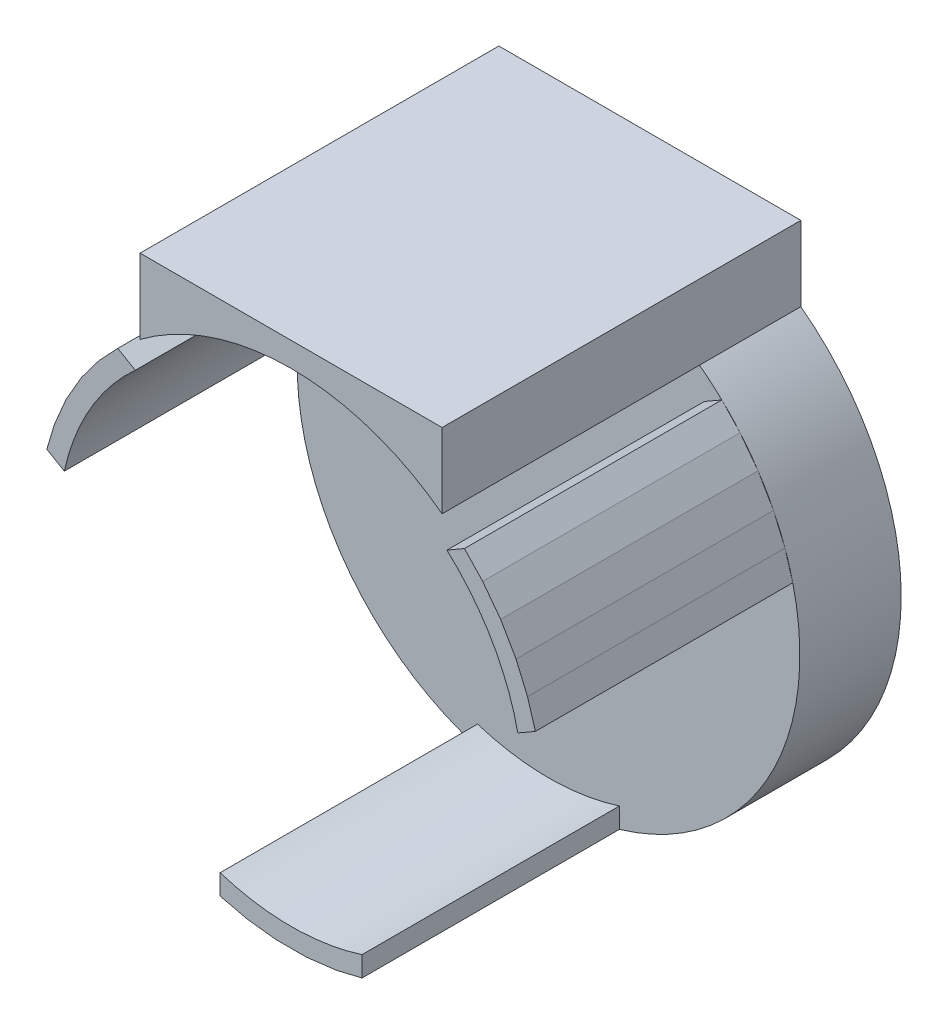
ISO-10303-21;
HEADER;
FILE_DESCRIPTION(('STEP AP214'),'2;1');
FILE_NAME('part.step','',(''),(''),'','','');
FILE_SCHEMA(('AUTOMOTIVE_DESIGN { 1 0 10303 214 1 1 1 1 }'));
ENDSEC;
DATA;
#1=APPLICATION_CONTEXT('core data for automotive mechanical design processes');
#2=APPLICATION_PROTOCOL_DEFINITION('international standard','automotive_design',2000,#1);
#3=PRODUCT_CONTEXT('',#1,'mechanical');
#4=PRODUCT('Part','Part','',(#3));
#5=PRODUCT_RELATED_PRODUCT_CATEGORY('part','',(#4));
#6=PRODUCT_DEFINITION_FORMATION('','',#4);
#7=PRODUCT_DEFINITION_CONTEXT('part definition',#1,'design');
#8=PRODUCT_DEFINITION('design','',#6,#7);
#9=PRODUCT_DEFINITION_SHAPE('','',#8);
#10=(LENGTH_UNIT() NAMED_UNIT(*) SI_UNIT(.MILLI.,.METRE.));
#11=(NAMED_UNIT(*) PLANE_ANGLE_UNIT() SI_UNIT($,.RADIAN.));
#12=(NAMED_UNIT(*) SI_UNIT($,.STERADIAN.) SOLID_ANGLE_UNIT());
#13=UNCERTAINTY_MEASURE_WITH_UNIT(LENGTH_MEASURE(1.E-05),#10,'distance_accuracy_value','');
#14=(GEOMETRIC_REPRESENTATION_CONTEXT(3) GLOBAL_UNCERTAINTY_ASSIGNED_CONTEXT((#13)) GLOBAL_UNIT_ASSIGNED_CONTEXT((#10,
#11,#12)) REPRESENTATION_CONTEXT('',''));
#15=CARTESIAN_POINT('',(0.,0.,0.));
#16=DIRECTION('',(0.,0.,1.));
#17=DIRECTION('',(1.,0.,0.));
#18=AXIS2_PLACEMENT_3D('',#15,#16,#17);
#19=CARTESIAN_POINT('',(0.,0.,5.));
#20=DIRECTION('',(0.,0.,-1.));
#21=DIRECTION('',(-1.,0.,0.));
#22=AXIS2_PLACEMENT_3D('',#19,#20,#21);
#23=PLANE('',#22);
#24=DIRECTION('',(-0.686711519341494,0.726930044229633,0.));
#25=VECTOR('',#24,1.);
#26=CARTESIAN_POINT('',(8.55206290021574,8.97898770189343,5.));
#27=LINE('',#26,#25);
#28=CARTESIAN_POINT('',(9.4506878529183,8.02773312378422,5.));
#29=VERTEX_POINT('',#28);
#30=CARTESIAN_POINT('',(8.55206290021575,8.97898770189343,5.));
#31=VERTEX_POINT('',#30);
#32=EDGE_CURVE('E267',#29,#31,#27,.T.);
#33=ORIENTED_EDGE('',*,*,#32,.F.);
#34=CARTESIAN_POINT('',(0.,0.,5.));
#35=DIRECTION('',(0.,0.,1.));
#36=DIRECTION('',(1.,0.,0.));
#37=AXIS2_PLACEMENT_3D('',#34,#35,#36);
#38=CIRCLE('',#37,12.4);
#39=EDGE_CURVE('E548',#29,#31,#38,.T.);
#40=ORIENTED_EDGE('',*,*,#39,.T.);
#41=EDGE_LOOP('',(#33,#40));
#42=FACE_BOUND('',#41,.T.);
#43=ADVANCED_FACE('F57',(#42),#23,.F.);
#44=DIRECTION('',(-0.866025403784444,-0.49999999999999,0.));
#45=VECTOR('',#44,1.);
#46=CARTESIAN_POINT('',(8.55206290021574,8.97898770189343,5.));
#47=LINE('',#46,#45);
#48=CARTESIAN_POINT('',(7.6860374964313,8.47898770189344,5.));
#49=VERTEX_POINT('',#48);
#50=EDGE_CURVE('E484',#31,#49,#47,.T.);
#51=ORIENTED_EDGE('',*,*,#50,.F.);
#52=CARTESIAN_POINT('',(7.45,9.91249211853407,5.));
#53=VERTEX_POINT('',#52);
#54=EDGE_CURVE('E265',#31,#53,#38,.T.);
#55=ORIENTED_EDGE('',*,*,#54,.T.);
#56=CARTESIAN_POINT('',(0.,0.,5.));
#57=DIRECTION('',(0.,0.,1.));
#58=DIRECTION('',(-1.,0.,0.));
#59=AXIS2_PLACEMENT_3D('',#56,#57,#58);
#60=CIRCLE('',#59,12.4);
#61=CARTESIAN_POINT('',(-7.45,9.91249211853407,5.));
#62=VERTEX_POINT('',#61);
#63=EDGE_CURVE('E248',#53,#62,#60,.T.);
#64=ORIENTED_EDGE('',*,*,#63,.T.);
#65=CARTESIAN_POINT('',(-8.55206290021562,8.97898770189355,5.));
#66=VERTEX_POINT('',#65);
#67=EDGE_CURVE('E262',#62,#66,#38,.T.);
#68=ORIENTED_EDGE('',*,*,#67,.T.);
#69=DIRECTION('',(-0.866025403784437,0.500000000000003,0.));
#70=VECTOR('',#69,1.);
#71=CARTESIAN_POINT('',(-8.55206290021563,8.97898770189355,5.));
#72=LINE('',#71,#70);
#73=CARTESIAN_POINT('',(-7.68603749643119,8.47898770189355,5.));
#74=VERTEX_POINT('',#73);
#75=EDGE_CURVE('E418',#74,#66,#72,.T.);
#76=ORIENTED_EDGE('',*,*,#75,.F.);
#77=CARTESIAN_POINT('',(0.,0.,5.));
#78=DIRECTION('',(0.,0.,-1.));
#79=DIRECTION('',(1.,0.,0.));
#80=AXIS2_PLACEMENT_3D('',#77,#78,#79);
#81=CIRCLE('',#80,11.4441428182896);
#82=CARTESIAN_POINT('',(-11.1860374964312,2.41680987540249,5.));
#83=VERTEX_POINT('',#82);
#84=EDGE_CURVE('E420',#83,#74,#81,.T.);
#85=ORIENTED_EDGE('',*,*,#84,.F.);
#86=DIRECTION('',(0.866025403784436,-0.500000000000004,0.));
#87=VECTOR('',#86,1.);
#88=CARTESIAN_POINT('',(-12.0520629002157,2.91680987540249,5.));
#89=LINE('',#88,#87);
#90=CARTESIAN_POINT('',(-12.0520629002157,2.91680987540249,5.));
#91=VERTEX_POINT('',#90);
#92=EDGE_CURVE('E423',#91,#83,#89,.T.);
#93=ORIENTED_EDGE('',*,*,#92,.F.);
#94=CARTESIAN_POINT('',(-3.50000000000001,-11.8957975772959,5.));
#95=VERTEX_POINT('',#94);
#96=EDGE_CURVE('E556',#91,#95,#38,.T.);
#97=ORIENTED_EDGE('',*,*,#96,.T.);
#98=DIRECTION('',(0.,-1.,0.));
#99=VECTOR('',#98,1.);
#100=CARTESIAN_POINT('',(-3.50000000000001,-11.8957975772959,5.));
#101=LINE('',#100,#99);
#102=CARTESIAN_POINT('',(-3.50000000000001,-10.8957975772959,5.));
#103=VERTEX_POINT('',#102);
#104=EDGE_CURVE('E353',#103,#95,#101,.T.);
#105=ORIENTED_EDGE('',*,*,#104,.F.);
#106=CARTESIAN_POINT('',(0.,0.,5.));
#107=DIRECTION('',(0.,0.,-1.));
#108=DIRECTION('',(1.,0.,0.));
#109=AXIS2_PLACEMENT_3D('',#106,#107,#108);
#110=CIRCLE('',#109,11.4441428182895);
#111=CARTESIAN_POINT('',(3.5,-10.8957975772959,5.));
#112=VERTEX_POINT('',#111);
#113=EDGE_CURVE('E356',#112,#103,#110,.T.);
#114=ORIENTED_EDGE('',*,*,#113,.F.);
#115=DIRECTION('',(0.,1.,0.));
#116=VECTOR('',#115,1.);
#117=CARTESIAN_POINT('',(3.5,-11.8957975772959,5.));
#118=LINE('',#117,#116);
#119=CARTESIAN_POINT('',(3.5,-11.8957975772959,5.));
#120=VERTEX_POINT('',#119);
#121=EDGE_CURVE('E359',#120,#112,#118,.T.);
#122=ORIENTED_EDGE('',*,*,#121,.F.);
#123=CARTESIAN_POINT('',(12.0520629002157,2.91680987540232,5.));
#124=VERTEX_POINT('',#123);
#125=EDGE_CURVE('E555',#120,#124,#38,.T.);
#126=ORIENTED_EDGE('',*,*,#125,.T.);
#127=DIRECTION('',(0.866025403784443,0.499999999999992,0.));
#128=VECTOR('',#127,1.);
#129=CARTESIAN_POINT('',(12.0520629002157,2.91680987540232,5.));
#130=LINE('',#129,#128);
#131=CARTESIAN_POINT('',(11.1860374964313,2.41680987540233,5.));
#132=VERTEX_POINT('',#131);
#133=EDGE_CURVE('E77',#132,#124,#130,.T.);
#134=ORIENTED_EDGE('',*,*,#133,.F.);
#135=CARTESIAN_POINT('',(0.,0.,5.));
#136=DIRECTION('',(0.,0.,-1.));
#137=DIRECTION('',(1.,0.,0.));
#138=AXIS2_PLACEMENT_3D('',#135,#136,#137);
#139=CIRCLE('',#138,11.4441428182895);
#140=EDGE_CURVE('E72',#49,#132,#139,.T.);
#141=ORIENTED_EDGE('',*,*,#140,.F.);
#142=EDGE_LOOP('',(#51,#55,#64,#68,#76,#85,#93,#97,#105,#114,#122,#126,#134,#141));
#143=FACE_BOUND('',#142,.T.);
#144=ADVANCED_FACE('F261',(#143),#23,.F.);
#145=DIRECTION('',(-0.287733652538625,0.957710470443328,0.));
#146=VECTOR('',#145,1.);
#147=CARTESIAN_POINT('',(11.66401107031,4.20842556684639,5.));
#148=LINE('',#147,#146);
#149=CARTESIAN_POINT('',(11.66401107031,4.20842556684627,5.));
#150=VERTEX_POINT('',#149);
#151=EDGE_CURVE('E479',#124,#150,#148,.T.);
#152=ORIENTED_EDGE('',*,*,#151,.F.);
#153=EDGE_CURVE('E552',#124,#150,#38,.T.);
#154=ORIENTED_EDGE('',*,*,#153,.T.);
#155=EDGE_LOOP('',(#152,#154));
#156=FACE_BOUND('',#155,.T.);
#157=ADVANCED_FACE('F628',(#156),#23,.F.);
#158=DIRECTION('',(-0.393355900948917,0.919386281814486,0.));
#159=VECTOR('',#158,1.);
#160=CARTESIAN_POINT('',(11.0984133929242,5.53039059739548,5.));
#161=LINE('',#160,#159);
#162=CARTESIAN_POINT('',(11.0984133929243,5.5303905973954,5.));
#163=VERTEX_POINT('',#162);
#164=EDGE_CURVE('E476',#150,#163,#161,.T.);
#165=ORIENTED_EDGE('',*,*,#164,.F.);
#166=EDGE_CURVE('E551',#150,#163,#38,.T.);
#167=ORIENTED_EDGE('',*,*,#166,.T.);
#168=EDGE_LOOP('',(#165,#167));
#169=FACE_BOUND('',#168,.T.);
#170=ADVANCED_FACE('F942',(#169),#23,.F.);
#171=DIRECTION('',(-0.499999999999992,0.866025403784443,0.));
#172=VECTOR('',#171,1.);
#173=CARTESIAN_POINT('',(10.3386654466573,6.84631264127592,5.));
#174=LINE('',#173,#172);
#175=CARTESIAN_POINT('',(10.3386654466573,6.84631264127592,5.));
#176=VERTEX_POINT('',#175);
#177=EDGE_CURVE('E473',#163,#176,#174,.T.);
#178=ORIENTED_EDGE('',*,*,#177,.F.);
#179=EDGE_CURVE('E545',#163,#176,#38,.T.);
#180=ORIENTED_EDGE('',*,*,#179,.T.);
#181=EDGE_LOOP('',(#178,#180));
#182=FACE_BOUND('',#181,.T.);
#183=ADVANCED_FACE('F550',(#182),#23,.F.);
#184=DIRECTION('',(-0.600827751338299,0.799378516862796,0.));
#185=VECTOR('',#184,1.);
#186=CARTESIAN_POINT('',(9.4506878529183,8.02773312378422,5.));
#187=LINE('',#186,#185);
#188=EDGE_CURVE('E469',#176,#29,#187,.T.);
#189=ORIENTED_EDGE('',*,*,#188,.F.);
#190=EDGE_CURVE('E540',#176,#29,#38,.T.);
#191=ORIENTED_EDGE('',*,*,#190,.T.);
#192=EDGE_LOOP('',(#189,#191));
#193=FACE_BOUND('',#192,.T.);
#194=ADVANCED_FACE('F539',(#193),#23,.F.);
#195=DIRECTION('',(-0.286184125406257,-0.958174642935961,0.));
#196=VECTOR('',#195,1.);
#197=CARTESIAN_POINT('',(-12.0520629002157,2.91680987540249,5.));
#198=LINE('',#197,#196);
#199=CARTESIAN_POINT('',(-11.6775647464581,4.1706692019721,5.));
#200=VERTEX_POINT('',#199);
#201=EDGE_CURVE('E426',#200,#91,#198,.T.);
#202=ORIENTED_EDGE('',*,*,#201,.F.);
#203=EDGE_CURVE('E560',#200,#91,#38,.T.);
#204=ORIENTED_EDGE('',*,*,#203,.T.);
#205=EDGE_LOOP('',(#202,#204));
#206=FACE_BOUND('',#205,.T.);
#207=ADVANCED_FACE('F918',(#206),#23,.F.);
#208=DIRECTION('',(-0.685534770604952,-0.728039887843802,0.));
#209=VECTOR('',#208,1.);
#210=CARTESIAN_POINT('',(-9.47660898597993,7.99711711348812,5.));
#211=LINE('',#210,#209);
#212=CARTESIAN_POINT('',(-9.47660898597989,7.99711711348816,5.));
#213=VERTEX_POINT('',#212);
#214=EDGE_CURVE('E415',#66,#213,#211,.T.);
#215=ORIENTED_EDGE('',*,*,#214,.F.);
#216=EDGE_CURVE('E277',#66,#213,#38,.T.);
#217=ORIENTED_EDGE('',*,*,#216,.T.);
#218=EDGE_LOOP('',(#215,#217));
#219=FACE_BOUND('',#218,.T.);
#220=ADVANCED_FACE('F909',(#219),#23,.F.);
#221=DIRECTION('',(-0.599533925467801,-0.800349343857524,0.));
#222=VECTOR('',#221,1.);
#223=CARTESIAN_POINT('',(-10.3386654466572,6.84631264127603,5.));
#224=LINE('',#223,#222);
#225=CARTESIAN_POINT('',(-10.3386654466572,6.84631264127604,5.));
#226=VERTEX_POINT('',#225);
#227=EDGE_CURVE('E412',#213,#226,#224,.T.);
#228=ORIENTED_EDGE('',*,*,#227,.F.);
#229=EDGE_CURVE('E1066',#213,#226,#38,.T.);
#230=ORIENTED_EDGE('',*,*,#229,.T.);
#231=EDGE_LOOP('',(#228,#230));
#232=FACE_BOUND('',#231,.T.);
#233=ADVANCED_FACE('F900',(#232),#23,.F.);
#234=DIRECTION('',(-0.500000000000003,-0.866025403784437,0.));
#235=VECTOR('',#234,1.);
#236=CARTESIAN_POINT('',(-11.0984133929242,5.5303905973956,5.));
#237=LINE('',#236,#235);
#238=CARTESIAN_POINT('',(-11.0984133929242,5.5303905973956,5.));
#239=VERTEX_POINT('',#238);
#240=EDGE_CURVE('E409',#226,#239,#237,.T.);
#241=ORIENTED_EDGE('',*,*,#240,.F.);
#242=EDGE_CURVE('E1064',#226,#239,#38,.T.);
#243=ORIENTED_EDGE('',*,*,#242,.T.);
#244=EDGE_LOOP('',(#241,#243));
#245=FACE_BOUND('',#244,.T.);
#246=ADVANCED_FACE('F638',(#245),#23,.F.);
#247=DIRECTION('',(-0.391868227173555,-0.920021354389046,0.));
#248=VECTOR('',#247,1.);
#249=CARTESIAN_POINT('',(-11.6775647464581,4.1706692019721,5.));
#250=LINE('',#249,#248);
#251=EDGE_CURVE('E405',#239,#200,#250,.T.);
#252=ORIENTED_EDGE('',*,*,#251,.F.);
#253=EDGE_CURVE('E564',#239,#200,#38,.T.);
#254=ORIENTED_EDGE('',*,*,#253,.T.);
#255=EDGE_LOOP('',(#252,#254));
#256=FACE_BOUND('',#255,.T.);
#257=ADVANCED_FACE('F632',(#256),#23,.F.);
#258=DIRECTION('',(0.972895644747753,0.231244598706334,0.));
#259=VECTOR('',#258,1.);
#260=CARTESIAN_POINT('',(3.5,-11.8957975772959,5.));
#261=LINE('',#260,#259);
#262=CARTESIAN_POINT('',(2.2268768935399,-12.1984023257564,5.));
#263=VERTEX_POINT('',#262);
#264=EDGE_CURVE('E362',#263,#120,#261,.T.);
#265=ORIENTED_EDGE('',*,*,#264,.F.);
#266=EDGE_CURVE('E559',#263,#120,#38,.T.);
#267=ORIENTED_EDGE('',*,*,#266,.T.);
#268=EDGE_LOOP('',(#265,#267));
#269=FACE_BOUND('',#268,.T.);
#270=ADVANCED_FACE('F583',(#269),#23,.F.);
#271=DIRECTION('',(0.973268423143583,-0.229670582599521,0.));
#272=VECTOR('',#271,1.);
#273=CARTESIAN_POINT('',(-2.18740208432998,-12.2055426803346,5.));
#274=LINE('',#273,#272);
#275=CARTESIAN_POINT('',(-2.18740208432992,-12.2055426803346,5.));
#276=VERTEX_POINT('',#275);
#277=EDGE_CURVE('E350',#95,#276,#274,.T.);
#278=ORIENTED_EDGE('',*,*,#277,.F.);
#279=EDGE_CURVE('E279',#95,#276,#38,.T.);
#280=ORIENTED_EDGE('',*,*,#279,.T.);
#281=EDGE_LOOP('',(#278,#280));
#282=FACE_BOUND('',#281,.T.);
#283=ADVANCED_FACE('F631',(#282),#23,.F.);
#284=DIRECTION('',(0.992889826416724,-0.119036937956956,0.));
#285=VECTOR('',#284,1.);
#286=CARTESIAN_POINT('',(-0.759747946266912,-12.3767032386716,5.));
#287=LINE('',#286,#285);
#288=CARTESIAN_POINT('',(-0.759747946266983,-12.3767032386716,5.));
#289=VERTEX_POINT('',#288);
#290=EDGE_CURVE('E347',#276,#289,#287,.T.);
#291=ORIENTED_EDGE('',*,*,#290,.F.);
#292=EDGE_CURVE('E566',#276,#289,#38,.T.);
#293=ORIENTED_EDGE('',*,*,#292,.T.);
#294=EDGE_LOOP('',(#291,#293));
#295=FACE_BOUND('',#294,.T.);
#296=ADVANCED_FACE('F637',(#295),#23,.F.);
#297=DIRECTION('',(1.,0.,0.));
#298=VECTOR('',#297,1.);
#299=CARTESIAN_POINT('',(0.759747946266947,-12.3767032386716,5.));
#300=LINE('',#299,#298);
#301=CARTESIAN_POINT('',(0.759747946266947,-12.3767032386716,5.));
#302=VERTEX_POINT('',#301);
#303=EDGE_CURVE('E344',#289,#302,#300,.T.);
#304=ORIENTED_EDGE('',*,*,#303,.F.);
#305=EDGE_CURVE('E570',#289,#302,#38,.T.);
#306=ORIENTED_EDGE('',*,*,#305,.T.);
#307=EDGE_LOOP('',(#304,#306));
#308=FACE_BOUND('',#307,.T.);
#309=ADVANCED_FACE('F641',(#308),#23,.F.);
#310=DIRECTION('',(0.992695978511857,0.120642837526258,0.));
#311=VECTOR('',#310,1.);
#312=CARTESIAN_POINT('',(2.2268768935399,-12.1984023257564,5.));
#313=LINE('',#312,#311);
#314=EDGE_CURVE('E340',#302,#263,#313,.T.);
#315=ORIENTED_EDGE('',*,*,#314,.F.);
#316=EDGE_CURVE('E574',#302,#263,#38,.T.);
#317=ORIENTED_EDGE('',*,*,#316,.T.);
#318=EDGE_LOOP('',(#315,#317));
#319=FACE_BOUND('',#318,.T.);
#320=ADVANCED_FACE('F597',(#319),#23,.F.);
#321=CARTESIAN_POINT('',(0.,0.,0.));
#322=DIRECTION('',(0.,0.,-1.));
#323=DIRECTION('',(-1.,0.,0.));
#324=AXIS2_PLACEMENT_3D('',#321,#322,#323);
#325=PLANE('',#324);
#326=CARTESIAN_POINT('',(0.,0.,0.));
#327=DIRECTION('',(0.,0.,1.));
#328=DIRECTION('',(1.,0.,0.));
#329=AXIS2_PLACEMENT_3D('',#326,#327,#328);
#330=CIRCLE('',#329,12.4);
#331=CARTESIAN_POINT('',(-7.45,9.91249211853407,0.));
#332=VERTEX_POINT('',#331);
#333=CARTESIAN_POINT('',(7.45,9.91249211853407,0.));
#334=VERTEX_POINT('',#333);
#335=EDGE_CURVE('E256',#332,#334,#330,.T.);
#336=ORIENTED_EDGE('',*,*,#335,.F.);
#337=DIRECTION('',(0.,-1.,0.));
#338=VECTOR('',#337,1.);
#339=CARTESIAN_POINT('',(-7.45,9.91249211853407,0.));
#340=LINE('',#339,#338);
#341=CARTESIAN_POINT('',(-7.45,13.6,0.));
#342=VERTEX_POINT('',#341);
#343=EDGE_CURVE('E283',#342,#332,#340,.T.);
#344=ORIENTED_EDGE('',*,*,#343,.F.);
#345=DIRECTION('',(-1.,0.,0.));
#346=VECTOR('',#345,1.);
#347=CARTESIAN_POINT('',(-7.45,13.6,0.));
#348=LINE('',#347,#346);
#349=CARTESIAN_POINT('',(7.45,13.6,0.));
#350=VERTEX_POINT('',#349);
#351=EDGE_CURVE('E295',#350,#342,#348,.T.);
#352=ORIENTED_EDGE('',*,*,#351,.F.);
#353=DIRECTION('',(0.,1.,0.));
#354=VECTOR('',#353,1.);
#355=CARTESIAN_POINT('',(7.45,9.91249211853407,0.));
#356=LINE('',#355,#354);
#357=EDGE_CURVE('E302',#334,#350,#356,.T.);
#358=ORIENTED_EDGE('',*,*,#357,.F.);
#359=EDGE_LOOP('',(#336,#344,#352,#358));
#360=FACE_BOUND('',#359,.T.);
#361=ADVANCED_FACE('F59',(#360),#325,.T.);
#362=CARTESIAN_POINT('',(0.,0.,5.));
#363=DIRECTION('',(0.,0.,-1.));
#364=DIRECTION('',(-1.,0.,0.));
#365=AXIS2_PLACEMENT_3D('',#362,#363,#364);
#366=CYLINDRICAL_SURFACE('',#365,12.4);
#367=ORIENTED_EDGE('',*,*,#335,.T.);
#368=DIRECTION('',(0.,0.,-1.));
#369=VECTOR('',#368,1.);
#370=CARTESIAN_POINT('',(7.45,9.91249211853407,5.));
#371=LINE('',#370,#369);
#372=EDGE_CURVE('E12',#53,#334,#371,.T.);
#373=ORIENTED_EDGE('',*,*,#372,.F.);
#374=ORIENTED_EDGE('',*,*,#54,.F.);
#375=ORIENTED_EDGE('',*,*,#39,.F.);
#376=ORIENTED_EDGE('',*,*,#190,.F.);
#377=ORIENTED_EDGE('',*,*,#179,.F.);
#378=ORIENTED_EDGE('',*,*,#166,.F.);
#379=ORIENTED_EDGE('',*,*,#153,.F.);
#380=ORIENTED_EDGE('',*,*,#125,.F.);
#381=ORIENTED_EDGE('',*,*,#266,.F.);
#382=ORIENTED_EDGE('',*,*,#316,.F.);
#383=ORIENTED_EDGE('',*,*,#305,.F.);
#384=ORIENTED_EDGE('',*,*,#292,.F.);
#385=ORIENTED_EDGE('',*,*,#279,.F.);
#386=ORIENTED_EDGE('',*,*,#96,.F.);
#387=ORIENTED_EDGE('',*,*,#203,.F.);
#388=ORIENTED_EDGE('',*,*,#253,.F.);
#389=ORIENTED_EDGE('',*,*,#242,.F.);
#390=ORIENTED_EDGE('',*,*,#229,.F.);
#391=ORIENTED_EDGE('',*,*,#216,.F.);
#392=ORIENTED_EDGE('',*,*,#67,.F.);
#393=DIRECTION('',(0.,0.,-1.));
#394=VECTOR('',#393,1.);
#395=CARTESIAN_POINT('',(-7.45,9.91249211853407,5.));
#396=LINE('',#395,#394);
#397=EDGE_CURVE('E273',#62,#332,#396,.T.);
#398=ORIENTED_EDGE('',*,*,#397,.T.);
#399=EDGE_LOOP('',(#367,#373,#374,#375,#376,#377,#378,#379,#380,#381,#382,#383,#384,#385,#386,
#387,#388,#389,#390,#391,#392,#398));
#400=FACE_BOUND('',#399,.T.);
#401=ADVANCED_FACE('F272',(#400),#366,.T.);
#402=CARTESIAN_POINT('',(7.45,9.91249211853407,5.));
#403=DIRECTION('',(-1.,0.,0.));
#404=DIRECTION('',(0.,0.,1.));
#405=AXIS2_PLACEMENT_3D('',#402,#403,#404);
#406=PLANE('',#405);
#407=ORIENTED_EDGE('',*,*,#357,.T.);
#408=DIRECTION('',(0.,0.,-1.));
#409=VECTOR('',#408,1.);
#410=CARTESIAN_POINT('',(7.45,13.6,5.));
#411=LINE('',#410,#409);
#412=CARTESIAN_POINT('',(7.45,13.6,17.7));
#413=VERTEX_POINT('',#412);
#414=EDGE_CURVE('E65',#413,#350,#411,.T.);
#415=ORIENTED_EDGE('',*,*,#414,.F.);
#416=DIRECTION('',(0.,1.,0.));
#417=VECTOR('',#416,1.);
#418=CARTESIAN_POINT('',(7.45,9.91249211853407,17.7));
#419=LINE('',#418,#417);
#420=CARTESIAN_POINT('',(7.45,9.91249211853407,17.7));
#421=VERTEX_POINT('',#420);
#422=EDGE_CURVE('E313',#421,#413,#419,.T.);
#423=ORIENTED_EDGE('',*,*,#422,.F.);
#424=DIRECTION('',(0.,0.,-1.));
#425=VECTOR('',#424,1.);
#426=CARTESIAN_POINT('',(7.45,9.91249211853407,17.7));
#427=LINE('',#426,#425);
#428=EDGE_CURVE('E257',#421,#53,#427,.T.);
#429=ORIENTED_EDGE('',*,*,#428,.T.);
#430=ORIENTED_EDGE('',*,*,#372,.T.);
#431=EDGE_LOOP('',(#407,#415,#423,#429,#430));
#432=FACE_BOUND('',#431,.T.);
#433=ADVANCED_FACE('F303',(#432),#406,.F.);
#434=CARTESIAN_POINT('',(-7.45,13.6,5.));
#435=DIRECTION('',(0.,-1.,0.));
#436=DIRECTION('',(1.,0.,0.));
#437=AXIS2_PLACEMENT_3D('',#434,#435,#436);
#438=PLANE('',#437);
#439=ORIENTED_EDGE('',*,*,#351,.T.);
#440=DIRECTION('',(0.,0.,-1.));
#441=VECTOR('',#440,1.);
#442=CARTESIAN_POINT('',(-7.45,13.6,5.));
#443=LINE('',#442,#441);
#444=CARTESIAN_POINT('',(-7.45,13.6,17.7));
#445=VERTEX_POINT('',#444);
#446=EDGE_CURVE('E285',#445,#342,#443,.T.);
#447=ORIENTED_EDGE('',*,*,#446,.F.);
#448=DIRECTION('',(-1.,0.,0.));
#449=VECTOR('',#448,1.);
#450=CARTESIAN_POINT('',(-7.45,13.6,17.7));
#451=LINE('',#450,#449);
#452=EDGE_CURVE('E297',#413,#445,#451,.T.);
#453=ORIENTED_EDGE('',*,*,#452,.F.);
#454=ORIENTED_EDGE('',*,*,#414,.T.);
#455=EDGE_LOOP('',(#439,#447,#453,#454));
#456=FACE_BOUND('',#455,.T.);
#457=ADVANCED_FACE('F293',(#456),#438,.F.);
#458=CARTESIAN_POINT('',(-7.45,9.91249211853407,5.));
#459=DIRECTION('',(1.,0.,0.));
#460=DIRECTION('',(0.,0.,-1.));
#461=AXIS2_PLACEMENT_3D('',#458,#459,#460);
#462=PLANE('',#461);
#463=ORIENTED_EDGE('',*,*,#343,.T.);
#464=ORIENTED_EDGE('',*,*,#397,.F.);
#465=DIRECTION('',(0.,0.,-1.));
#466=VECTOR('',#465,1.);
#467=CARTESIAN_POINT('',(-7.45,9.91249211853407,17.7));
#468=LINE('',#467,#466);
#469=CARTESIAN_POINT('',(-7.45,9.91249211853407,17.7));
#470=VERTEX_POINT('',#469);
#471=EDGE_CURVE('E245',#470,#62,#468,.T.);
#472=ORIENTED_EDGE('',*,*,#471,.F.);
#473=DIRECTION('',(0.,-1.,0.));
#474=VECTOR('',#473,1.);
#475=CARTESIAN_POINT('',(-7.45,13.6,17.7));
#476=LINE('',#475,#474);
#477=EDGE_CURVE('E310',#445,#470,#476,.T.);
#478=ORIENTED_EDGE('',*,*,#477,.F.);
#479=ORIENTED_EDGE('',*,*,#446,.T.);
#480=EDGE_LOOP('',(#463,#464,#472,#478,#479));
#481=FACE_BOUND('',#480,.T.);
#482=ADVANCED_FACE('F280',(#481),#462,.F.);
#483=CARTESIAN_POINT('',(0.,0.,17.7));
#484=DIRECTION('',(0.,0.,-1.));
#485=DIRECTION('',(-1.,0.,0.));
#486=AXIS2_PLACEMENT_3D('',#483,#484,#485);
#487=PLANE('',#486);
#488=ORIENTED_EDGE('',*,*,#477,.T.);
#489=CARTESIAN_POINT('',(0.,0.,17.7));
#490=DIRECTION('',(0.,0.,1.));
#491=DIRECTION('',(-1.,0.,0.));
#492=AXIS2_PLACEMENT_3D('',#489,#490,#491);
#493=CIRCLE('',#492,12.4);
#494=EDGE_CURVE('E251',#421,#470,#493,.T.);
#495=ORIENTED_EDGE('',*,*,#494,.F.);
#496=ORIENTED_EDGE('',*,*,#422,.T.);
#497=ORIENTED_EDGE('',*,*,#452,.T.);
#498=EDGE_LOOP('',(#488,#495,#496,#497));
#499=FACE_BOUND('',#498,.T.);
#500=ADVANCED_FACE('F845',(#499),#487,.F.);
#501=CARTESIAN_POINT('',(3.5,-11.8957975772959,17.7));
#502=DIRECTION('',(-0.231244598706334,0.972895644747753,0.));
#503=DIRECTION('',(-0.972895644747753,-0.231244598706334,0.));
#504=AXIS2_PLACEMENT_3D('',#501,#502,#503);
#505=PLANE('',#504);
#506=ORIENTED_EDGE('',*,*,#264,.T.);
#507=DIRECTION('',(0.,0.,-1.));
#508=VECTOR('',#507,1.);
#509=CARTESIAN_POINT('',(3.5,-11.8957975772959,17.7));
#510=LINE('',#509,#508);
#511=CARTESIAN_POINT('',(3.5,-11.8957975772959,17.7));
#512=VERTEX_POINT('',#511);
#513=EDGE_CURVE('E315',#512,#120,#510,.T.);
#514=ORIENTED_EDGE('',*,*,#513,.F.);
#515=DIRECTION('',(0.972895644747753,0.231244598706334,0.));
#516=VECTOR('',#515,1.);
#517=CARTESIAN_POINT('',(3.5,-11.8957975772959,17.7));
#518=LINE('',#517,#516);
#519=CARTESIAN_POINT('',(2.2268768935399,-12.1984023257564,17.7));
#520=VERTEX_POINT('',#519);
#521=EDGE_CURVE('E343',#520,#512,#518,.T.);
#522=ORIENTED_EDGE('',*,*,#521,.F.);
#523=DIRECTION('',(0.,0.,-1.));
#524=VECTOR('',#523,1.);
#525=CARTESIAN_POINT('',(2.2268768935399,-12.1984023257564,17.7));
#526=LINE('',#525,#524);
#527=EDGE_CURVE('E336',#520,#263,#526,.T.);
#528=ORIENTED_EDGE('',*,*,#527,.T.);
#529=EDGE_LOOP('',(#506,#514,#522,#528));
#530=FACE_BOUND('',#529,.T.);
#531=ADVANCED_FACE('F591',(#530),#505,.F.);
#532=CARTESIAN_POINT('',(3.5,-11.8957975772959,17.7));
#533=DIRECTION('',(-1.,0.,0.));
#534=DIRECTION('',(0.,0.,1.));
#535=AXIS2_PLACEMENT_3D('',#532,#533,#534);
#536=PLANE('',#535);
#537=ORIENTED_EDGE('',*,*,#121,.T.);
#538=DIRECTION('',(0.,0.,-1.));
#539=VECTOR('',#538,1.);
#540=CARTESIAN_POINT('',(3.5,-10.8957975772959,17.7));
#541=LINE('',#540,#539);
#542=CARTESIAN_POINT('',(3.5,-10.8957975772959,17.7));
#543=VERTEX_POINT('',#542);
#544=EDGE_CURVE('E318',#543,#112,#541,.T.);
#545=ORIENTED_EDGE('',*,*,#544,.F.);
#546=DIRECTION('',(0.,1.,0.));
#547=VECTOR('',#546,1.);
#548=CARTESIAN_POINT('',(3.5,-11.8957975772959,17.7));
#549=LINE('',#548,#547);
#550=EDGE_CURVE('E377',#512,#543,#549,.T.);
#551=ORIENTED_EDGE('',*,*,#550,.F.);
#552=ORIENTED_EDGE('',*,*,#513,.T.);
#553=EDGE_LOOP('',(#537,#545,#551,#552));
#554=FACE_BOUND('',#553,.T.);
#555=ADVANCED_FACE('F587',(#554),#536,.F.);
#556=CARTESIAN_POINT('',(0.,0.,17.7));
#557=DIRECTION('',(0.,0.,-1.));
#558=DIRECTION('',(-1.,0.,0.));
#559=AXIS2_PLACEMENT_3D('',#556,#557,#558);
#560=CYLINDRICAL_SURFACE('',#559,11.4441428182895);
#561=ORIENTED_EDGE('',*,*,#113,.T.);
#562=DIRECTION('',(0.,0.,-1.));
#563=VECTOR('',#562,1.);
#564=CARTESIAN_POINT('',(-3.50000000000001,-10.8957975772959,17.7));
#565=LINE('',#564,#563);
#566=CARTESIAN_POINT('',(-3.50000000000001,-10.8957975772959,17.7));
#567=VERTEX_POINT('',#566);
#568=EDGE_CURVE('E321',#567,#103,#565,.T.);
#569=ORIENTED_EDGE('',*,*,#568,.F.);
#570=CARTESIAN_POINT('',(0.,0.,17.7));
#571=DIRECTION('',(0.,0.,-1.));
#572=DIRECTION('',(1.,0.,0.));
#573=AXIS2_PLACEMENT_3D('',#570,#571,#572);
#574=CIRCLE('',#573,11.4441428182895);
#575=EDGE_CURVE('E375',#543,#567,#574,.T.);
#576=ORIENTED_EDGE('',*,*,#575,.F.);
#577=ORIENTED_EDGE('',*,*,#544,.T.);
#578=EDGE_LOOP('',(#561,#569,#576,#577));
#579=FACE_BOUND('',#578,.T.);
#580=ADVANCED_FACE('F614',(#579),#560,.F.);
#581=CARTESIAN_POINT('',(-3.50000000000001,-11.8957975772959,17.7));
#582=DIRECTION('',(1.,0.,0.));
#583=DIRECTION('',(0.,0.,-1.));
#584=AXIS2_PLACEMENT_3D('',#581,#582,#583);
#585=PLANE('',#584);
#586=ORIENTED_EDGE('',*,*,#104,.T.);
#587=DIRECTION('',(0.,0.,-1.));
#588=VECTOR('',#587,1.);
#589=CARTESIAN_POINT('',(-3.50000000000001,-11.8957975772959,17.7));
#590=LINE('',#589,#588);
#591=CARTESIAN_POINT('',(-3.50000000000001,-11.8957975772959,17.7));
#592=VERTEX_POINT('',#591);
#593=EDGE_CURVE('E324',#592,#95,#590,.T.);
#594=ORIENTED_EDGE('',*,*,#593,.F.);
#595=DIRECTION('',(0.,-1.,0.));
#596=VECTOR('',#595,1.);
#597=CARTESIAN_POINT('',(-3.50000000000001,-11.8957975772959,17.7));
#598=LINE('',#597,#596);
#599=EDGE_CURVE('E373',#567,#592,#598,.T.);
#600=ORIENTED_EDGE('',*,*,#599,.F.);
#601=ORIENTED_EDGE('',*,*,#568,.T.);
#602=EDGE_LOOP('',(#586,#594,#600,#601));
#603=FACE_BOUND('',#602,.T.);
#604=ADVANCED_FACE('F601',(#603),#585,.F.);
#605=CARTESIAN_POINT('',(-2.18740208432998,-12.2055426803346,17.7));
#606=DIRECTION('',(0.22967058259952,0.973268423143583,0.));
#607=DIRECTION('',(-0.973268423143583,0.229670582599521,0.));
#608=AXIS2_PLACEMENT_3D('',#605,#606,#607);
#609=PLANE('',#608);
#610=ORIENTED_EDGE('',*,*,#277,.T.);
#611=DIRECTION('',(0.,0.,-1.));
#612=VECTOR('',#611,1.);
#613=CARTESIAN_POINT('',(-2.18740208432998,-12.2055426803346,17.7));
#614=LINE('',#613,#612);
#615=CARTESIAN_POINT('',(-2.18740208432998,-12.2055426803346,17.7));
#616=VERTEX_POINT('',#615);
#617=EDGE_CURVE('E327',#616,#276,#614,.T.);
#618=ORIENTED_EDGE('',*,*,#617,.F.);
#619=DIRECTION('',(0.973268423143583,-0.229670582599521,0.));
#620=VECTOR('',#619,1.);
#621=CARTESIAN_POINT('',(-2.18740208432998,-12.2055426803346,17.7));
#622=LINE('',#621,#620);
#623=EDGE_CURVE('E371',#592,#616,#622,.T.);
#624=ORIENTED_EDGE('',*,*,#623,.F.);
#625=ORIENTED_EDGE('',*,*,#593,.T.);
#626=EDGE_LOOP('',(#610,#618,#624,#625));
#627=FACE_BOUND('',#626,.T.);
#628=ADVANCED_FACE('F606',(#627),#609,.F.);
#629=CARTESIAN_POINT('',(-0.759747946266912,-12.3767032386716,17.7));
#630=DIRECTION('',(0.119036937956956,0.992889826416724,0.));
#631=DIRECTION('',(-0.992889826416724,0.119036937956956,0.));
#632=AXIS2_PLACEMENT_3D('',#629,#630,#631);
#633=PLANE('',#632);
#634=ORIENTED_EDGE('',*,*,#290,.T.);
#635=DIRECTION('',(0.,0.,-1.));
#636=VECTOR('',#635,1.);
#637=CARTESIAN_POINT('',(-0.759747946266912,-12.3767032386716,17.7));
#638=LINE('',#637,#636);
#639=CARTESIAN_POINT('',(-0.759747946266912,-12.3767032386716,17.7));
#640=VERTEX_POINT('',#639);
#641=EDGE_CURVE('E330',#640,#289,#638,.T.);
#642=ORIENTED_EDGE('',*,*,#641,.F.);
#643=DIRECTION('',(0.992889826416724,-0.119036937956956,0.));
#644=VECTOR('',#643,1.);
#645=CARTESIAN_POINT('',(-0.759747946266912,-12.3767032386716,17.7));
#646=LINE('',#645,#644);
#647=EDGE_CURVE('E369',#616,#640,#646,.T.);
#648=ORIENTED_EDGE('',*,*,#647,.F.);
#649=ORIENTED_EDGE('',*,*,#617,.T.);
#650=EDGE_LOOP('',(#634,#642,#648,#649));
#651=FACE_BOUND('',#650,.T.);
#652=ADVANCED_FACE('F653',(#651),#633,.F.);
#653=CARTESIAN_POINT('',(0.759747946266947,-12.3767032386716,17.7));
#654=DIRECTION('',(0.,1.,0.));
#655=DIRECTION('',(0.,0.,1.));
#656=AXIS2_PLACEMENT_3D('',#653,#654,#655);
#657=PLANE('',#656);
#658=ORIENTED_EDGE('',*,*,#303,.T.);
#659=DIRECTION('',(0.,0.,-1.));
#660=VECTOR('',#659,1.);
#661=CARTESIAN_POINT('',(0.759747946266947,-12.3767032386716,17.7));
#662=LINE('',#661,#660);
#663=CARTESIAN_POINT('',(0.759747946266947,-12.3767032386716,17.7));
#664=VERTEX_POINT('',#663);
#665=EDGE_CURVE('E333',#664,#302,#662,.T.);
#666=ORIENTED_EDGE('',*,*,#665,.F.);
#667=DIRECTION('',(1.,0.,0.));
#668=VECTOR('',#667,1.);
#669=CARTESIAN_POINT('',(0.759747946266947,-12.3767032386716,17.7));
#670=LINE('',#669,#668);
#671=EDGE_CURVE('E367',#640,#664,#670,.T.);
#672=ORIENTED_EDGE('',*,*,#671,.F.);
#673=ORIENTED_EDGE('',*,*,#641,.T.);
#674=EDGE_LOOP('',(#658,#666,#672,#673));
#675=FACE_BOUND('',#674,.T.);
#676=ADVANCED_FACE('F650',(#675),#657,.F.);
#677=CARTESIAN_POINT('',(2.2268768935399,-12.1984023257564,17.7));
#678=DIRECTION('',(-0.120642837526258,0.992695978511857,0.));
#679=DIRECTION('',(-0.992695978511857,-0.120642837526258,0.));
#680=AXIS2_PLACEMENT_3D('',#677,#678,#679);
#681=PLANE('',#680);
#682=ORIENTED_EDGE('',*,*,#314,.T.);
#683=ORIENTED_EDGE('',*,*,#527,.F.);
#684=DIRECTION('',(0.992695978511857,0.120642837526258,0.));
#685=VECTOR('',#684,1.);
#686=CARTESIAN_POINT('',(2.2268768935399,-12.1984023257564,17.7));
#687=LINE('',#686,#685);
#688=EDGE_CURVE('E339',#664,#520,#687,.T.);
#689=ORIENTED_EDGE('',*,*,#688,.F.);
#690=ORIENTED_EDGE('',*,*,#665,.T.);
#691=EDGE_LOOP('',(#682,#683,#689,#690));
#692=FACE_BOUND('',#691,.T.);
#693=ADVANCED_FACE('F595',(#692),#681,.F.);
#694=CARTESIAN_POINT('',(0.,0.,17.7));
#695=DIRECTION('',(0.,0.,1.));
#696=DIRECTION('',(1.,0.,0.));
#697=AXIS2_PLACEMENT_3D('',#694,#695,#696);
#698=PLANE('',#697);
#699=ORIENTED_EDGE('',*,*,#521,.T.);
#700=ORIENTED_EDGE('',*,*,#550,.T.);
#701=ORIENTED_EDGE('',*,*,#575,.T.);
#702=ORIENTED_EDGE('',*,*,#599,.T.);
#703=ORIENTED_EDGE('',*,*,#623,.T.);
#704=ORIENTED_EDGE('',*,*,#647,.T.);
#705=ORIENTED_EDGE('',*,*,#671,.T.);
#706=ORIENTED_EDGE('',*,*,#688,.T.);
#707=EDGE_LOOP('',(#699,#700,#701,#702,#703,#704,#705,#706));
#708=FACE_BOUND('',#707,.T.);
#709=ADVANCED_FACE('F610',(#708),#698,.T.);
#710=CARTESIAN_POINT('',(-12.0520629002157,2.91680987540249,17.7));
#711=DIRECTION('',(0.958174642935961,-0.286184125406257,0.));
#712=DIRECTION('',(0.286184125406257,0.958174642935961,0.));
#713=AXIS2_PLACEMENT_3D('',#710,#711,#712);
#714=PLANE('',#713);
#715=ORIENTED_EDGE('',*,*,#201,.T.);
#716=DIRECTION('',(0.,0.,-1.));
#717=VECTOR('',#716,1.);
#718=CARTESIAN_POINT('',(-12.0520629002157,2.91680987540249,17.7));
#719=LINE('',#718,#717);
#720=CARTESIAN_POINT('',(-12.0520629002157,2.91680987540249,17.7));
#721=VERTEX_POINT('',#720);
#722=EDGE_CURVE('E365',#721,#91,#719,.T.);
#723=ORIENTED_EDGE('',*,*,#722,.F.);
#724=DIRECTION('',(-0.286184125406257,-0.958174642935961,0.));
#725=VECTOR('',#724,1.);
#726=CARTESIAN_POINT('',(-12.0520629002157,2.91680987540249,17.7));
#727=LINE('',#726,#725);
#728=CARTESIAN_POINT('',(-11.6775647464581,4.1706692019721,17.7));
#729=VERTEX_POINT('',#728);
#730=EDGE_CURVE('E408',#729,#721,#727,.T.);
#731=ORIENTED_EDGE('',*,*,#730,.F.);
#732=DIRECTION('',(0.,0.,-1.));
#733=VECTOR('',#732,1.);
#734=CARTESIAN_POINT('',(-11.6775647464581,4.1706692019721,17.7));
#735=LINE('',#734,#733);
#736=EDGE_CURVE('E401',#729,#200,#735,.T.);
#737=ORIENTED_EDGE('',*,*,#736,.T.);
#738=EDGE_LOOP('',(#715,#723,#731,#737));
#739=FACE_BOUND('',#738,.T.);
#740=ADVANCED_FACE('F667',(#739),#714,.F.);
#741=CARTESIAN_POINT('',(-12.0520629002157,2.91680987540249,17.7));
#742=DIRECTION('',(0.500000000000004,0.866025403784436,0.));
#743=DIRECTION('',(-0.866025403784436,0.500000000000004,0.));
#744=AXIS2_PLACEMENT_3D('',#741,#742,#743);
#745=PLANE('',#744);
#746=ORIENTED_EDGE('',*,*,#92,.T.);
#747=DIRECTION('',(0.,0.,-1.));
#748=VECTOR('',#747,1.);
#749=CARTESIAN_POINT('',(-11.1860374964312,2.41680987540249,17.7));
#750=LINE('',#749,#748);
#751=CARTESIAN_POINT('',(-11.1860374964312,2.41680987540249,17.7));
#752=VERTEX_POINT('',#751);
#753=EDGE_CURVE('E383',#752,#83,#750,.T.);
#754=ORIENTED_EDGE('',*,*,#753,.F.);
#755=DIRECTION('',(0.866025403784436,-0.500000000000004,0.));
#756=VECTOR('',#755,1.);
#757=CARTESIAN_POINT('',(-12.0520629002157,2.91680987540249,17.7));
#758=LINE('',#757,#756);
#759=EDGE_CURVE('E441',#721,#752,#758,.T.);
#760=ORIENTED_EDGE('',*,*,#759,.F.);
#761=ORIENTED_EDGE('',*,*,#722,.T.);
#762=EDGE_LOOP('',(#746,#754,#760,#761));
#763=FACE_BOUND('',#762,.T.);
#764=ADVANCED_FACE('F670',(#763),#745,.F.);
#765=CARTESIAN_POINT('',(0.,0.,17.7));
#766=DIRECTION('',(0.,0.,-1.));
#767=DIRECTION('',(-1.,0.,0.));
#768=AXIS2_PLACEMENT_3D('',#765,#766,#767);
#769=CYLINDRICAL_SURFACE('',#768,11.4441428182896);
#770=ORIENTED_EDGE('',*,*,#84,.T.);
#771=DIRECTION('',(0.,0.,-1.));
#772=VECTOR('',#771,1.);
#773=CARTESIAN_POINT('',(-7.6860374964312,8.47898770189355,17.7));
#774=LINE('',#773,#772);
#775=CARTESIAN_POINT('',(-7.6860374964312,8.47898770189355,17.7));
#776=VERTEX_POINT('',#775);
#777=EDGE_CURVE('E386',#776,#74,#774,.T.);
#778=ORIENTED_EDGE('',*,*,#777,.F.);
#779=CARTESIAN_POINT('',(0.,0.,17.7));
#780=DIRECTION('',(0.,0.,-1.));
#781=DIRECTION('',(1.,0.,0.));
#782=AXIS2_PLACEMENT_3D('',#779,#780,#781);
#783=CIRCLE('',#782,11.4441428182896);
#784=EDGE_CURVE('E439',#752,#776,#783,.T.);
#785=ORIENTED_EDGE('',*,*,#784,.F.);
#786=ORIENTED_EDGE('',*,*,#753,.T.);
#787=EDGE_LOOP('',(#770,#778,#785,#786));
#788=FACE_BOUND('',#787,.T.);
#789=ADVANCED_FACE('F674',(#788),#769,.F.);
#790=CARTESIAN_POINT('',(-8.55206290021563,8.97898770189355,17.7));
#791=DIRECTION('',(-0.500000000000003,-0.866025403784437,0.));
#792=DIRECTION('',(0.866025403784437,-0.500000000000003,0.));
#793=AXIS2_PLACEMENT_3D('',#790,#791,#792);
#794=PLANE('',#793);
#795=ORIENTED_EDGE('',*,*,#75,.T.);
#796=DIRECTION('',(0.,0.,-1.));
#797=VECTOR('',#796,1.);
#798=CARTESIAN_POINT('',(-8.55206290021563,8.97898770189355,17.7));
#799=LINE('',#798,#797);
#800=CARTESIAN_POINT('',(-8.55206290021563,8.97898770189355,17.7));
#801=VERTEX_POINT('',#800);
#802=EDGE_CURVE('E389',#801,#66,#799,.T.);
#803=ORIENTED_EDGE('',*,*,#802,.F.);
#804=DIRECTION('',(-0.866025403784437,0.500000000000003,0.));
#805=VECTOR('',#804,1.);
#806=CARTESIAN_POINT('',(-8.55206290021563,8.97898770189355,17.7));
#807=LINE('',#806,#805);
#808=EDGE_CURVE('E437',#776,#801,#807,.T.);
#809=ORIENTED_EDGE('',*,*,#808,.F.);
#810=ORIENTED_EDGE('',*,*,#777,.T.);
#811=EDGE_LOOP('',(#795,#803,#809,#810));
#812=FACE_BOUND('',#811,.T.);
#813=ADVANCED_FACE('F678',(#812),#794,.F.);
#814=CARTESIAN_POINT('',(-9.47660898597993,7.99711711348812,17.7));
#815=DIRECTION('',(0.728039887843802,-0.685534770604952,0.));
#816=DIRECTION('',(0.685534770604952,0.728039887843802,0.));
#817=AXIS2_PLACEMENT_3D('',#814,#815,#816);
#818=PLANE('',#817);
#819=ORIENTED_EDGE('',*,*,#214,.T.);
#820=DIRECTION('',(0.,0.,-1.));
#821=VECTOR('',#820,1.);
#822=CARTESIAN_POINT('',(-9.47660898597993,7.99711711348812,17.7));
#823=LINE('',#822,#821);
#824=CARTESIAN_POINT('',(-9.47660898597993,7.99711711348812,17.7));
#825=VERTEX_POINT('',#824);
#826=EDGE_CURVE('E392',#825,#213,#823,.T.);
#827=ORIENTED_EDGE('',*,*,#826,.F.);
#828=DIRECTION('',(-0.685534770604952,-0.728039887843802,0.));
#829=VECTOR('',#828,1.);
#830=CARTESIAN_POINT('',(-9.47660898597993,7.99711711348812,17.7));
#831=LINE('',#830,#829);
#832=EDGE_CURVE('E435',#801,#825,#831,.T.);
#833=ORIENTED_EDGE('',*,*,#832,.F.);
#834=ORIENTED_EDGE('',*,*,#802,.T.);
#835=EDGE_LOOP('',(#819,#827,#833,#834));
#836=FACE_BOUND('',#835,.T.);
#837=ADVANCED_FACE('F682',(#836),#818,.F.);
#838=CARTESIAN_POINT('',(-10.3386654466572,6.84631264127603,17.7));
#839=DIRECTION('',(0.800349343857524,-0.599533925467802,0.));
#840=DIRECTION('',(0.599533925467802,0.800349343857524,0.));
#841=AXIS2_PLACEMENT_3D('',#838,#839,#840);
#842=PLANE('',#841);
#843=ORIENTED_EDGE('',*,*,#227,.T.);
#844=DIRECTION('',(0.,0.,-1.));
#845=VECTOR('',#844,1.);
#846=CARTESIAN_POINT('',(-10.3386654466572,6.84631264127603,17.7));
#847=LINE('',#846,#845);
#848=CARTESIAN_POINT('',(-10.3386654466572,6.84631264127603,17.7));
#849=VERTEX_POINT('',#848);
#850=EDGE_CURVE('E395',#849,#226,#847,.T.);
#851=ORIENTED_EDGE('',*,*,#850,.F.);
#852=DIRECTION('',(-0.599533925467801,-0.800349343857524,0.));
#853=VECTOR('',#852,1.);
#854=CARTESIAN_POINT('',(-10.3386654466572,6.84631264127603,17.7));
#855=LINE('',#854,#853);
#856=EDGE_CURVE('E433',#825,#849,#855,.T.);
#857=ORIENTED_EDGE('',*,*,#856,.F.);
#858=ORIENTED_EDGE('',*,*,#826,.T.);
#859=EDGE_LOOP('',(#843,#851,#857,#858));
#860=FACE_BOUND('',#859,.T.);
#861=ADVANCED_FACE('F686',(#860),#842,.F.);
#862=CARTESIAN_POINT('',(-11.0984133929242,5.5303905973956,17.7));
#863=DIRECTION('',(0.866025403784437,-0.500000000000003,0.));
#864=DIRECTION('',(0.500000000000003,0.866025403784437,0.));
#865=AXIS2_PLACEMENT_3D('',#862,#863,#864);
#866=PLANE('',#865);
#867=ORIENTED_EDGE('',*,*,#240,.T.);
#868=DIRECTION('',(0.,0.,-1.));
#869=VECTOR('',#868,1.);
#870=CARTESIAN_POINT('',(-11.0984133929242,5.5303905973956,17.7));
#871=LINE('',#870,#869);
#872=CARTESIAN_POINT('',(-11.0984133929242,5.5303905973956,17.7));
#873=VERTEX_POINT('',#872);
#874=EDGE_CURVE('E398',#873,#239,#871,.T.);
#875=ORIENTED_EDGE('',*,*,#874,.F.);
#876=DIRECTION('',(-0.500000000000003,-0.866025403784437,0.));
#877=VECTOR('',#876,1.);
#878=CARTESIAN_POINT('',(-11.0984133929242,5.5303905973956,17.7));
#879=LINE('',#878,#877);
#880=EDGE_CURVE('E431',#849,#873,#879,.T.);
#881=ORIENTED_EDGE('',*,*,#880,.F.);
#882=ORIENTED_EDGE('',*,*,#850,.T.);
#883=EDGE_LOOP('',(#867,#875,#881,#882));
#884=FACE_BOUND('',#883,.T.);
#885=ADVANCED_FACE('F690',(#884),#866,.F.);
#886=CARTESIAN_POINT('',(-11.6775647464581,4.1706692019721,17.7));
#887=DIRECTION('',(0.920021354389046,-0.391868227173555,0.));
#888=DIRECTION('',(0.391868227173555,0.920021354389046,0.));
#889=AXIS2_PLACEMENT_3D('',#886,#887,#888);
#890=PLANE('',#889);
#891=ORIENTED_EDGE('',*,*,#251,.T.);
#892=ORIENTED_EDGE('',*,*,#736,.F.);
#893=DIRECTION('',(-0.391868227173555,-0.920021354389046,0.));
#894=VECTOR('',#893,1.);
#895=CARTESIAN_POINT('',(-11.6775647464581,4.1706692019721,17.7));
#896=LINE('',#895,#894);
#897=EDGE_CURVE('E404',#873,#729,#896,.T.);
#898=ORIENTED_EDGE('',*,*,#897,.F.);
#899=ORIENTED_EDGE('',*,*,#874,.T.);
#900=EDGE_LOOP('',(#891,#892,#898,#899));
#901=FACE_BOUND('',#900,.T.);
#902=ADVANCED_FACE('F694',(#901),#890,.F.);
#903=CARTESIAN_POINT('',(0.,0.,17.7));
#904=DIRECTION('',(0.,0.,1.));
#905=DIRECTION('',(1.,0.,0.));
#906=AXIS2_PLACEMENT_3D('',#903,#904,#905);
#907=PLANE('',#906);
#908=ORIENTED_EDGE('',*,*,#730,.T.);
#909=ORIENTED_EDGE('',*,*,#759,.T.);
#910=ORIENTED_EDGE('',*,*,#784,.T.);
#911=ORIENTED_EDGE('',*,*,#808,.T.);
#912=ORIENTED_EDGE('',*,*,#832,.T.);
#913=ORIENTED_EDGE('',*,*,#856,.T.);
#914=ORIENTED_EDGE('',*,*,#880,.T.);
#915=ORIENTED_EDGE('',*,*,#897,.T.);
#916=EDGE_LOOP('',(#908,#909,#910,#911,#912,#913,#914,#915));
#917=FACE_BOUND('',#916,.T.);
#918=ADVANCED_FACE('F698',(#917),#907,.T.);
#919=CARTESIAN_POINT('',(8.55206290021574,8.97898770189343,17.7));
#920=DIRECTION('',(-0.726930044229633,-0.686711519341494,0.));
#921=DIRECTION('',(0.686711519341494,-0.726930044229633,0.));
#922=AXIS2_PLACEMENT_3D('',#919,#920,#921);
#923=PLANE('',#922);
#924=ORIENTED_EDGE('',*,*,#32,.T.);
#925=DIRECTION('',(0.,0.,-1.));
#926=VECTOR('',#925,1.);
#927=CARTESIAN_POINT('',(8.55206290021574,8.97898770189343,17.7));
#928=LINE('',#927,#926);
#929=CARTESIAN_POINT('',(8.55206290021574,8.97898770189343,17.7));
#930=VERTEX_POINT('',#929);
#931=EDGE_CURVE('E429',#930,#31,#928,.T.);
#932=ORIENTED_EDGE('',*,*,#931,.F.);
#933=DIRECTION('',(-0.686711519341494,0.726930044229633,0.));
#934=VECTOR('',#933,1.);
#935=CARTESIAN_POINT('',(8.55206290021574,8.97898770189343,17.7));
#936=LINE('',#935,#934);
#937=CARTESIAN_POINT('',(9.4506878529183,8.02773312378422,17.7));
#938=VERTEX_POINT('',#937);
#939=EDGE_CURVE('E472',#938,#930,#936,.T.);
#940=ORIENTED_EDGE('',*,*,#939,.F.);
#941=DIRECTION('',(0.,0.,-1.));
#942=VECTOR('',#941,1.);
#943=CARTESIAN_POINT('',(9.4506878529183,8.02773312378422,17.7));
#944=LINE('',#943,#942);
#945=EDGE_CURVE('E465',#938,#29,#944,.T.);
#946=ORIENTED_EDGE('',*,*,#945,.T.);
#947=EDGE_LOOP('',(#924,#932,#940,#946));
#948=FACE_BOUND('',#947,.T.);
#949=ADVANCED_FACE('F511',(#948),#923,.F.);
#950=CARTESIAN_POINT('',(8.55206290021574,8.97898770189343,17.7));
#951=DIRECTION('',(0.49999999999999,-0.866025403784444,0.));
#952=DIRECTION('',(0.866025403784444,0.49999999999999,0.));
#953=AXIS2_PLACEMENT_3D('',#950,#951,#952);
#954=PLANE('',#953);
#955=ORIENTED_EDGE('',*,*,#50,.T.);
#956=DIRECTION('',(0.,0.,-1.));
#957=VECTOR('',#956,1.);
#958=CARTESIAN_POINT('',(7.6860374964313,8.47898770189344,17.7));
#959=LINE('',#958,#957);
#960=CARTESIAN_POINT('',(7.6860374964313,8.47898770189344,17.7));
#961=VERTEX_POINT('',#960);
#962=EDGE_CURVE('E447',#961,#49,#959,.T.);
#963=ORIENTED_EDGE('',*,*,#962,.F.);
#964=DIRECTION('',(-0.866025403784444,-0.49999999999999,0.));
#965=VECTOR('',#964,1.);
#966=CARTESIAN_POINT('',(8.55206290021574,8.97898770189343,17.7));
#967=LINE('',#966,#965);
#968=EDGE_CURVE('E499',#930,#961,#967,.T.);
#969=ORIENTED_EDGE('',*,*,#968,.F.);
#970=ORIENTED_EDGE('',*,*,#931,.T.);
#971=EDGE_LOOP('',(#955,#963,#969,#970));
#972=FACE_BOUND('',#971,.T.);
#973=ADVANCED_FACE('F514',(#972),#954,.F.);
#974=CARTESIAN_POINT('',(0.,0.,17.7));
#975=DIRECTION('',(0.,0.,-1.));
#976=DIRECTION('',(-1.,0.,0.));
#977=AXIS2_PLACEMENT_3D('',#974,#975,#976);
#978=CYLINDRICAL_SURFACE('',#977,11.4441428182895);
#979=ORIENTED_EDGE('',*,*,#140,.T.);
#980=DIRECTION('',(0.,0.,-1.));
#981=VECTOR('',#980,1.);
#982=CARTESIAN_POINT('',(11.1860374964313,2.41680987540233,17.7));
#983=LINE('',#982,#981);
#984=CARTESIAN_POINT('',(11.1860374964313,2.41680987540233,17.7));
#985=VERTEX_POINT('',#984);
#986=EDGE_CURVE('E450',#985,#132,#983,.T.);
#987=ORIENTED_EDGE('',*,*,#986,.F.);
#988=CARTESIAN_POINT('',(0.,0.,17.7));
#989=DIRECTION('',(0.,0.,-1.));
#990=DIRECTION('',(1.,0.,0.));
#991=AXIS2_PLACEMENT_3D('',#988,#989,#990);
#992=CIRCLE('',#991,11.4441428182895);
#993=EDGE_CURVE('E497',#961,#985,#992,.T.);
#994=ORIENTED_EDGE('',*,*,#993,.F.);
#995=ORIENTED_EDGE('',*,*,#962,.T.);
#996=EDGE_LOOP('',(#979,#987,#994,#995));
#997=FACE_BOUND('',#996,.T.);
#998=ADVANCED_FACE('F518',(#997),#978,.F.);
#999=CARTESIAN_POINT('',(12.0520629002157,2.91680987540232,17.7));
#1000=DIRECTION('',(-0.499999999999992,0.866025403784443,0.));
#1001=DIRECTION('',(-0.866025403784443,-0.499999999999992,0.));
#1002=AXIS2_PLACEMENT_3D('',#999,#1000,#1001);
#1003=PLANE('',#1002);
#1004=ORIENTED_EDGE('',*,*,#133,.T.);
#1005=DIRECTION('',(0.,0.,-1.));
#1006=VECTOR('',#1005,1.);
#1007=CARTESIAN_POINT('',(12.0520629002157,2.91680987540232,17.7));
#1008=LINE('',#1007,#1006);
#1009=CARTESIAN_POINT('',(12.0520629002157,2.91680987540232,17.7));
#1010=VERTEX_POINT('',#1009);
#1011=EDGE_CURVE('E453',#1010,#124,#1008,.T.);
#1012=ORIENTED_EDGE('',*,*,#1011,.F.);
#1013=DIRECTION('',(0.866025403784443,0.499999999999992,0.));
#1014=VECTOR('',#1013,1.);
#1015=CARTESIAN_POINT('',(12.0520629002157,2.91680987540232,17.7));
#1016=LINE('',#1015,#1014);
#1017=EDGE_CURVE('E495',#985,#1010,#1016,.T.);
#1018=ORIENTED_EDGE('',*,*,#1017,.F.);
#1019=ORIENTED_EDGE('',*,*,#986,.T.);
#1020=EDGE_LOOP('',(#1004,#1012,#1018,#1019));
#1021=FACE_BOUND('',#1020,.T.);
#1022=ADVANCED_FACE('F524',(#1021),#1003,.F.);
#1023=CARTESIAN_POINT('',(11.66401107031,4.20842556684639,17.7));
#1024=DIRECTION('',(-0.957710470443328,-0.287733652538625,0.));
#1025=DIRECTION('',(0.287733652538626,-0.957710470443329,0.));
#1026=AXIS2_PLACEMENT_3D('',#1023,#1024,#1025);
#1027=PLANE('',#1026);
#1028=ORIENTED_EDGE('',*,*,#151,.T.);
#1029=DIRECTION('',(0.,0.,-1.));
#1030=VECTOR('',#1029,1.);
#1031=CARTESIAN_POINT('',(11.66401107031,4.20842556684639,17.7));
#1032=LINE('',#1031,#1030);
#1033=CARTESIAN_POINT('',(11.66401107031,4.20842556684639,17.7));
#1034=VERTEX_POINT('',#1033);
#1035=EDGE_CURVE('E456',#1034,#150,#1032,.T.);
#1036=ORIENTED_EDGE('',*,*,#1035,.F.);
#1037=DIRECTION('',(-0.287733652538625,0.957710470443328,0.));
#1038=VECTOR('',#1037,1.);
#1039=CARTESIAN_POINT('',(11.66401107031,4.20842556684639,17.7));
#1040=LINE('',#1039,#1038);
#1041=EDGE_CURVE('E493',#1010,#1034,#1040,.T.);
#1042=ORIENTED_EDGE('',*,*,#1041,.F.);
#1043=ORIENTED_EDGE('',*,*,#1011,.T.);
#1044=EDGE_LOOP('',(#1028,#1036,#1042,#1043));
#1045=FACE_BOUND('',#1044,.T.);
#1046=ADVANCED_FACE('F526',(#1045),#1027,.F.);
#1047=CARTESIAN_POINT('',(11.0984133929242,5.53039059739548,17.7));
#1048=DIRECTION('',(-0.919386281814486,-0.393355900948917,0.));
#1049=DIRECTION('',(0.393355900948917,-0.919386281814486,0.));
#1050=AXIS2_PLACEMENT_3D('',#1047,#1048,#1049);
#1051=PLANE('',#1050);
#1052=ORIENTED_EDGE('',*,*,#164,.T.);
#1053=DIRECTION('',(0.,0.,-1.));
#1054=VECTOR('',#1053,1.);
#1055=CARTESIAN_POINT('',(11.0984133929242,5.53039059739548,17.7));
#1056=LINE('',#1055,#1054);
#1057=CARTESIAN_POINT('',(11.0984133929242,5.53039059739548,17.7));
#1058=VERTEX_POINT('',#1057);
#1059=EDGE_CURVE('E459',#1058,#163,#1056,.T.);
#1060=ORIENTED_EDGE('',*,*,#1059,.F.);
#1061=DIRECTION('',(-0.393355900948917,0.919386281814486,0.));
#1062=VECTOR('',#1061,1.);
#1063=CARTESIAN_POINT('',(11.0984133929242,5.53039059739548,17.7));
#1064=LINE('',#1063,#1062);
#1065=EDGE_CURVE('E491',#1034,#1058,#1064,.T.);
#1066=ORIENTED_EDGE('',*,*,#1065,.F.);
#1067=ORIENTED_EDGE('',*,*,#1035,.T.);
#1068=EDGE_LOOP('',(#1052,#1060,#1066,#1067));
#1069=FACE_BOUND('',#1068,.T.);
#1070=ADVANCED_FACE('F530',(#1069),#1051,.F.);
#1071=CARTESIAN_POINT('',(10.3386654466573,6.84631264127592,17.7));
#1072=DIRECTION('',(-0.866025403784443,-0.499999999999992,0.));
#1073=DIRECTION('',(0.499999999999992,-0.866025403784443,0.));
#1074=AXIS2_PLACEMENT_3D('',#1071,#1072,#1073);
#1075=PLANE('',#1074);
#1076=ORIENTED_EDGE('',*,*,#177,.T.);
#1077=DIRECTION('',(0.,0.,-1.));
#1078=VECTOR('',#1077,1.);
#1079=CARTESIAN_POINT('',(10.3386654466573,6.84631264127592,17.7));
#1080=LINE('',#1079,#1078);
#1081=CARTESIAN_POINT('',(10.3386654466573,6.84631264127592,17.7));
#1082=VERTEX_POINT('',#1081);
#1083=EDGE_CURVE('E462',#1082,#176,#1080,.T.);
#1084=ORIENTED_EDGE('',*,*,#1083,.F.);
#1085=DIRECTION('',(-0.499999999999992,0.866025403784443,0.));
#1086=VECTOR('',#1085,1.);
#1087=CARTESIAN_POINT('',(10.3386654466573,6.84631264127592,17.7));
#1088=LINE('',#1087,#1086);
#1089=EDGE_CURVE('E489',#1058,#1082,#1088,.T.);
#1090=ORIENTED_EDGE('',*,*,#1089,.F.);
#1091=ORIENTED_EDGE('',*,*,#1059,.T.);
#1092=EDGE_LOOP('',(#1076,#1084,#1090,#1091));
#1093=FACE_BOUND('',#1092,.T.);
#1094=ADVANCED_FACE('F534',(#1093),#1075,.F.);
#1095=CARTESIAN_POINT('',(9.4506878529183,8.02773312378422,17.7));
#1096=DIRECTION('',(-0.799378516862796,-0.600827751338299,0.));
#1097=DIRECTION('',(0.600827751338299,-0.799378516862796,0.));
#1098=AXIS2_PLACEMENT_3D('',#1095,#1096,#1097);
#1099=PLANE('',#1098);
#1100=ORIENTED_EDGE('',*,*,#188,.T.);
#1101=ORIENTED_EDGE('',*,*,#945,.F.);
#1102=DIRECTION('',(-0.600827751338299,0.799378516862796,0.));
#1103=VECTOR('',#1102,1.);
#1104=CARTESIAN_POINT('',(9.4506878529183,8.02773312378422,17.7));
#1105=LINE('',#1104,#1103);
#1106=EDGE_CURVE('E468',#1082,#938,#1105,.T.);
#1107=ORIENTED_EDGE('',*,*,#1106,.F.);
#1108=ORIENTED_EDGE('',*,*,#1083,.T.);
#1109=EDGE_LOOP('',(#1100,#1101,#1107,#1108));
#1110=FACE_BOUND('',#1109,.T.);
#1111=ADVANCED_FACE('F536',(#1110),#1099,.F.);
#1112=CARTESIAN_POINT('',(0.,0.,17.7));
#1113=DIRECTION('',(0.,0.,1.));
#1114=DIRECTION('',(1.,0.,0.));
#1115=AXIS2_PLACEMENT_3D('',#1112,#1113,#1114);
#1116=PLANE('',#1115);
#1117=ORIENTED_EDGE('',*,*,#939,.T.);
#1118=ORIENTED_EDGE('',*,*,#968,.T.);
#1119=ORIENTED_EDGE('',*,*,#993,.T.);
#1120=ORIENTED_EDGE('',*,*,#1017,.T.);
#1121=ORIENTED_EDGE('',*,*,#1041,.T.);
#1122=ORIENTED_EDGE('',*,*,#1065,.T.);
#1123=ORIENTED_EDGE('',*,*,#1089,.T.);
#1124=ORIENTED_EDGE('',*,*,#1106,.T.);
#1125=EDGE_LOOP('',(#1117,#1118,#1119,#1120,#1121,#1122,#1123,#1124));
#1126=FACE_BOUND('',#1125,.T.);
#1127=ADVANCED_FACE('F506',(#1126),#1116,.T.);
#1128=CARTESIAN_POINT('',(0.,0.,5.));
#1129=DIRECTION('',(0.,0.,1.));
#1130=DIRECTION('',(1.,0.,0.));
#1131=AXIS2_PLACEMENT_3D('',#1128,#1129,#1130);
#1132=CYLINDRICAL_SURFACE('',#1131,12.4);
#1133=ORIENTED_EDGE('',*,*,#494,.T.);
#1134=ORIENTED_EDGE('',*,*,#471,.T.);
#1135=ORIENTED_EDGE('',*,*,#63,.F.);
#1136=ORIENTED_EDGE('',*,*,#428,.F.);
#1137=EDGE_LOOP('',(#1133,#1134,#1135,#1136));
#1138=FACE_BOUND('',#1137,.T.);
#1139=ADVANCED_FACE('F247',(#1138),#1132,.F.);
#1140=CLOSED_SHELL('',(#43,#144,#157,#170,#183,#194,#207,#220,#233,#246,#257,#270,#283,#296,
#309,#320,#361,#401,#433,#457,#482,#500,#531,#555,#580,#604,#628,#652,#676,#693,#709,#740,#764,
#789,#813,#837,#861,#885,#902,#918,#949,#973,#998,#1022,#1046,#1070,#1094,#1111,#1127,#1139));
#1141=MANIFOLD_SOLID_BREP('B2',#1140);
#1142=ADVANCED_BREP_SHAPE_REPRESENTATION('',(#18,#1141),#14);
#1143=SHAPE_DEFINITION_REPRESENTATION(#9,#1142);
ENDSEC;
END-ISO-10303-21;
